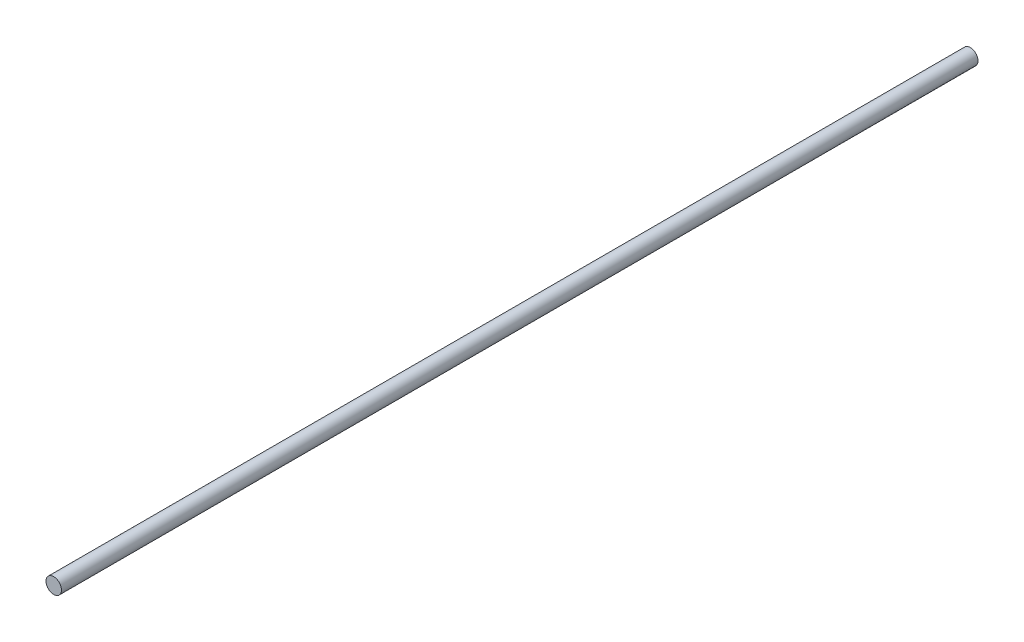
ISO-10303-21;
HEADER;
FILE_DESCRIPTION(('STEP AP214'),'2;1');
FILE_NAME('part.step','',(''),(''),'','','');
FILE_SCHEMA(('AUTOMOTIVE_DESIGN { 1 0 10303 214 1 1 1 1 }'));
ENDSEC;
DATA;
#1=APPLICATION_CONTEXT('core data for automotive mechanical design processes');
#2=APPLICATION_PROTOCOL_DEFINITION('international standard','automotive_design',2000,#1);
#3=PRODUCT_CONTEXT('',#1,'mechanical');
#4=PRODUCT('Part','Part','',(#3));
#5=PRODUCT_RELATED_PRODUCT_CATEGORY('part','',(#4));
#6=PRODUCT_DEFINITION_FORMATION('','',#4);
#7=PRODUCT_DEFINITION_CONTEXT('part definition',#1,'design');
#8=PRODUCT_DEFINITION('design','',#6,#7);
#9=PRODUCT_DEFINITION_SHAPE('','',#8);
#10=(LENGTH_UNIT() NAMED_UNIT(*) SI_UNIT(.MILLI.,.METRE.));
#11=(NAMED_UNIT(*) PLANE_ANGLE_UNIT() SI_UNIT($,.RADIAN.));
#12=(NAMED_UNIT(*) SI_UNIT($,.STERADIAN.) SOLID_ANGLE_UNIT());
#13=UNCERTAINTY_MEASURE_WITH_UNIT(LENGTH_MEASURE(1.E-05),#10,'distance_accuracy_value','');
#14=(GEOMETRIC_REPRESENTATION_CONTEXT(3) GLOBAL_UNCERTAINTY_ASSIGNED_CONTEXT((#13)) GLOBAL_UNIT_ASSIGNED_CONTEXT((#10,
#11,#12)) REPRESENTATION_CONTEXT('',''));
#15=CARTESIAN_POINT('',(0.,0.,0.));
#16=DIRECTION('',(0.,0.,1.));
#17=DIRECTION('',(1.,0.,0.));
#18=AXIS2_PLACEMENT_3D('',#15,#16,#17);
#19=CARTESIAN_POINT('',(0.,0.,480.));
#20=DIRECTION('',(0.,0.,-1.));
#21=DIRECTION('',(-1.,0.,0.));
#22=AXIS2_PLACEMENT_3D('',#19,#20,#21);
#23=CYLINDRICAL_SURFACE('',#22,4.05);
#24=CARTESIAN_POINT('',(0.,0.,480.));
#25=DIRECTION('',(0.,0.,1.));
#26=DIRECTION('',(1.,0.,0.));
#27=AXIS2_PLACEMENT_3D('',#24,#25,#26);
#28=CIRCLE('',#27,4.05);
#29=CARTESIAN_POINT('',(4.05,0.,480.));
#30=VERTEX_POINT('',#29);
#31=EDGE_CURVE('E10',#30,#30,#28,.T.);
#32=ORIENTED_EDGE('',*,*,#31,.F.);
#33=EDGE_LOOP('',(#32));
#34=FACE_BOUND('',#33,.T.);
#35=CARTESIAN_POINT('',(0.,0.,0.));
#36=DIRECTION('',(0.,0.,1.));
#37=DIRECTION('',(1.,0.,0.));
#38=AXIS2_PLACEMENT_3D('',#35,#36,#37);
#39=CIRCLE('',#38,4.05);
#40=CARTESIAN_POINT('',(4.05,0.,0.));
#41=VERTEX_POINT('',#40);
#42=EDGE_CURVE('E40',#41,#41,#39,.T.);
#43=ORIENTED_EDGE('',*,*,#42,.T.);
#44=EDGE_LOOP('',(#43));
#45=FACE_BOUND('',#44,.T.);
#46=ADVANCED_FACE('F37',(#34,#45),#23,.T.);
#47=CARTESIAN_POINT('',(0.,0.,480.));
#48=DIRECTION('',(0.,0.,1.));
#49=DIRECTION('',(1.,0.,0.));
#50=AXIS2_PLACEMENT_3D('',#47,#48,#49);
#51=PLANE('',#50);
#52=ORIENTED_EDGE('',*,*,#31,.T.);
#53=EDGE_LOOP('',(#52));
#54=FACE_BOUND('',#53,.T.);
#55=ADVANCED_FACE('F54',(#54),#51,.T.);
#56=CARTESIAN_POINT('',(0.,0.,0.));
#57=DIRECTION('',(0.,0.,1.));
#58=DIRECTION('',(1.,0.,0.));
#59=AXIS2_PLACEMENT_3D('',#56,#57,#58);
#60=PLANE('',#59);
#61=ORIENTED_EDGE('',*,*,#42,.F.);
#62=EDGE_LOOP('',(#61));
#63=FACE_BOUND('',#62,.T.);
#64=ADVANCED_FACE('F52',(#63),#60,.F.);
#65=CLOSED_SHELL('',(#46,#55,#64));
#66=MANIFOLD_SOLID_BREP('B2',#65);
#67=ADVANCED_BREP_SHAPE_REPRESENTATION('',(#18,#66),#14);
#68=SHAPE_DEFINITION_REPRESENTATION(#9,#67);
ENDSEC;
END-ISO-10303-21;
